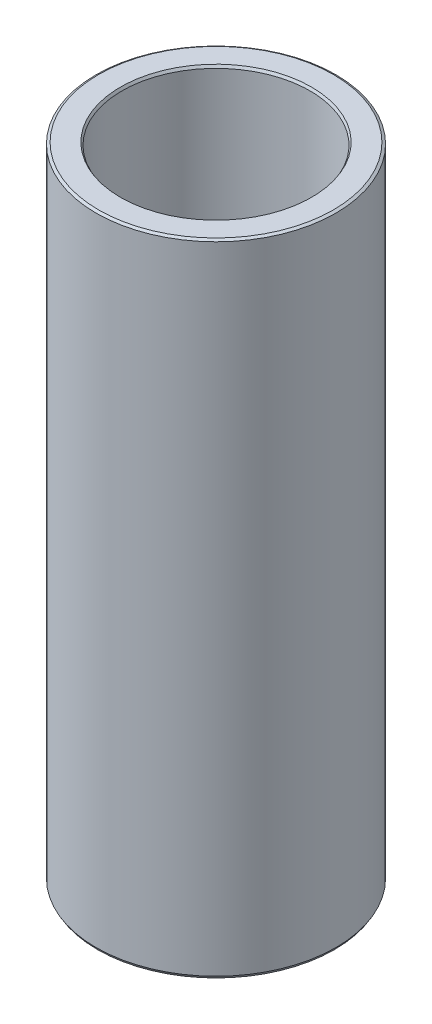
ISO-10303-21;
HEADER;
FILE_DESCRIPTION(('STEP AP214'),'2;1');
FILE_NAME('part.step','',(''),(''),'','','');
FILE_SCHEMA(('AUTOMOTIVE_DESIGN { 1 0 10303 214 1 1 1 1 }'));
ENDSEC;
DATA;
#1=APPLICATION_CONTEXT('core data for automotive mechanical design processes');
#2=APPLICATION_PROTOCOL_DEFINITION('international standard','automotive_design',2000,#1);
#3=PRODUCT_CONTEXT('',#1,'mechanical');
#4=PRODUCT('Part','Part','',(#3));
#5=PRODUCT_RELATED_PRODUCT_CATEGORY('part','',(#4));
#6=PRODUCT_DEFINITION_FORMATION('','',#4);
#7=PRODUCT_DEFINITION_CONTEXT('part definition',#1,'design');
#8=PRODUCT_DEFINITION('design','',#6,#7);
#9=PRODUCT_DEFINITION_SHAPE('','',#8);
#10=(LENGTH_UNIT() NAMED_UNIT(*) SI_UNIT(.MILLI.,.METRE.));
#11=(NAMED_UNIT(*) PLANE_ANGLE_UNIT() SI_UNIT($,.RADIAN.));
#12=(NAMED_UNIT(*) SI_UNIT($,.STERADIAN.) SOLID_ANGLE_UNIT());
#13=UNCERTAINTY_MEASURE_WITH_UNIT(LENGTH_MEASURE(1.E-05),#10,'distance_accuracy_value','');
#14=(GEOMETRIC_REPRESENTATION_CONTEXT(3) GLOBAL_UNCERTAINTY_ASSIGNED_CONTEXT((#13)) GLOBAL_UNIT_ASSIGNED_CONTEXT((#10,
#11,#12)) REPRESENTATION_CONTEXT('',''));
#15=CARTESIAN_POINT('',(0.,0.,0.));
#16=DIRECTION('',(0.,0.,1.));
#17=DIRECTION('',(1.,0.,0.));
#18=AXIS2_PLACEMENT_3D('',#15,#16,#17);
#19=CARTESIAN_POINT('',(0.,320.300888699564,0.));
#20=DIRECTION('',(0.,-1.,0.));
#21=DIRECTION('',(0.,0.,-1.));
#22=AXIS2_PLACEMENT_3D('',#19,#20,#21);
#23=CYLINDRICAL_SURFACE('',#22,60.);
#24=CARTESIAN_POINT('',(0.,1.28127196468975,0.));
#25=DIRECTION('',(0.,1.,0.));
#26=DIRECTION('',(0.,0.,1.));
#27=AXIS2_PLACEMENT_3D('',#24,#25,#26);
#28=CIRCLE('',#27,60.);
#29=CARTESIAN_POINT('',(0.,1.28127196468975,60.));
#30=VERTEX_POINT('',#29);
#31=EDGE_CURVE('E10',#30,#30,#28,.T.);
#32=ORIENTED_EDGE('',*,*,#31,.T.);
#33=EDGE_LOOP('',(#32));
#34=FACE_BOUND('',#33,.T.);
#35=CARTESIAN_POINT('',(0.,319.561145985845,0.));
#36=DIRECTION('',(0.,1.,0.));
#37=DIRECTION('',(0.,0.,1.));
#38=AXIS2_PLACEMENT_3D('',#35,#36,#37);
#39=CIRCLE('',#38,60.);
#40=CARTESIAN_POINT('',(0.,319.561145985845,60.));
#41=VERTEX_POINT('',#40);
#42=EDGE_CURVE('E50',#41,#41,#39,.F.);
#43=ORIENTED_EDGE('',*,*,#42,.T.);
#44=EDGE_LOOP('',(#43));
#45=FACE_BOUND('',#44,.T.);
#46=ADVANCED_FACE('F39',(#34,#45),#23,.T.);
#47=CARTESIAN_POINT('',(0.,320.300888699564,0.));
#48=DIRECTION('',(0.,1.,0.));
#49=DIRECTION('',(0.,0.,1.));
#50=AXIS2_PLACEMENT_3D('',#47,#48,#49);
#51=PLANE('',#50);
#52=CARTESIAN_POINT('',(0.,320.300888699564,0.));
#53=DIRECTION('',(0.,1.,0.));
#54=DIRECTION('',(0.,0.,1.));
#55=AXIS2_PLACEMENT_3D('',#52,#53,#54);
#56=CIRCLE('',#55,47.8190559067818);
#57=CARTESIAN_POINT('',(0.,320.300888699564,47.8190559067818));
#58=VERTEX_POINT('',#57);
#59=EDGE_CURVE('E58',#58,#58,#56,.F.);
#60=ORIENTED_EDGE('',*,*,#59,.T.);
#61=EDGE_LOOP('',(#60));
#62=FACE_BOUND('',#61,.T.);
#63=CARTESIAN_POINT('',(0.,320.300888699564,0.));
#64=DIRECTION('',(0.,1.,0.));
#65=DIRECTION('',(0.,0.,1.));
#66=AXIS2_PLACEMENT_3D('',#63,#64,#65);
#67=CIRCLE('',#66,58.7187280353102);
#68=CARTESIAN_POINT('',(0.,320.300888699564,58.7187280353102));
#69=VERTEX_POINT('',#68);
#70=EDGE_CURVE('E61',#69,#69,#67,.T.);
#71=ORIENTED_EDGE('',*,*,#70,.T.);
#72=EDGE_LOOP('',(#71));
#73=FACE_BOUND('',#72,.T.);
#74=ADVANCED_FACE('F88',(#62,#73),#51,.T.);
#75=CARTESIAN_POINT('',(0.,0.,0.));
#76=DIRECTION('',(0.,1.,0.));
#77=DIRECTION('',(0.,0.,1.));
#78=AXIS2_PLACEMENT_3D('',#75,#76,#77);
#79=PLANE('',#78);
#80=CARTESIAN_POINT('',(0.,0.,0.));
#81=DIRECTION('',(0.,1.,0.));
#82=DIRECTION('',(0.,0.,1.));
#83=AXIS2_PLACEMENT_3D('',#80,#81,#82);
#84=CIRCLE('',#83,48.3605851577527);
#85=CARTESIAN_POINT('',(0.,0.,48.3605851577527));
#86=VERTEX_POINT('',#85);
#87=EDGE_CURVE('E51',#86,#86,#84,.T.);
#88=ORIENTED_EDGE('',*,*,#87,.T.);
#89=EDGE_LOOP('',(#88));
#90=FACE_BOUND('',#89,.T.);
#91=CARTESIAN_POINT('',(0.,0.,0.));
#92=DIRECTION('',(0.,1.,0.));
#93=DIRECTION('',(0.,0.,1.));
#94=AXIS2_PLACEMENT_3D('',#91,#92,#93);
#95=CIRCLE('',#94,59.2602572862813);
#96=CARTESIAN_POINT('',(0.,0.,59.2602572862813));
#97=VERTEX_POINT('',#96);
#98=EDGE_CURVE('E54',#97,#97,#95,.F.);
#99=ORIENTED_EDGE('',*,*,#98,.T.);
#100=EDGE_LOOP('',(#99));
#101=FACE_BOUND('',#100,.T.);
#102=ADVANCED_FACE('F83',(#90,#101),#79,.F.);
#103=CARTESIAN_POINT('',(0.,320.300888699564,0.));
#104=DIRECTION('',(0.,-1.,0.));
#105=DIRECTION('',(0.,0.,-1.));
#106=AXIS2_PLACEMENT_3D('',#103,#104,#105);
#107=CYLINDRICAL_SURFACE('',#106,47.079313193063);
#108=CARTESIAN_POINT('',(0.,319.019616734874,0.));
#109=DIRECTION('',(0.,1.,0.));
#110=DIRECTION('',(0.,0.,1.));
#111=AXIS2_PLACEMENT_3D('',#108,#109,#110);
#112=CIRCLE('',#111,47.079313193063);
#113=CARTESIAN_POINT('',(0.,319.019616734874,47.079313193063));
#114=VERTEX_POINT('',#113);
#115=EDGE_CURVE('E67',#114,#114,#112,.T.);
#116=ORIENTED_EDGE('',*,*,#115,.T.);
#117=EDGE_LOOP('',(#116));
#118=FACE_BOUND('',#117,.T.);
#119=CARTESIAN_POINT('',(0.,0.739742713718738,0.));
#120=DIRECTION('',(0.,1.,0.));
#121=DIRECTION('',(0.,0.,1.));
#122=AXIS2_PLACEMENT_3D('',#119,#120,#121);
#123=CIRCLE('',#122,47.079313193063);
#124=CARTESIAN_POINT('',(0.,0.739742713718738,47.079313193063));
#125=VERTEX_POINT('',#124);
#126=EDGE_CURVE('E69',#125,#125,#123,.F.);
#127=ORIENTED_EDGE('',*,*,#126,.T.);
#128=EDGE_LOOP('',(#127));
#129=FACE_BOUND('',#128,.T.);
#130=ADVANCED_FACE('F71',(#118,#129),#107,.F.);
#131=CARTESIAN_POINT('',(0.,319.019616734874,0.));
#132=DIRECTION('',(0.,1.,0.));
#133=DIRECTION('',(0.,0.,1.));
#134=AXIS2_PLACEMENT_3D('',#131,#132,#133);
#135=CONICAL_SURFACE('',#134,47.079313193063,0.523598775598313);
#136=ORIENTED_EDGE('',*,*,#59,.F.);
#137=EDGE_LOOP('',(#136));
#138=FACE_BOUND('',#137,.T.);
#139=ORIENTED_EDGE('',*,*,#115,.F.);
#140=EDGE_LOOP('',(#139));
#141=FACE_BOUND('',#140,.T.);
#142=ADVANCED_FACE('F77',(#138,#141),#135,.F.);
#143=CARTESIAN_POINT('',(0.,0.,0.));
#144=DIRECTION('',(0.,-1.,0.));
#145=DIRECTION('',(0.,0.,-1.));
#146=AXIS2_PLACEMENT_3D('',#143,#144,#145);
#147=CONICAL_SURFACE('',#146,48.3605851577527,1.0471975511966);
#148=ORIENTED_EDGE('',*,*,#126,.F.);
#149=EDGE_LOOP('',(#148));
#150=FACE_BOUND('',#149,.T.);
#151=ORIENTED_EDGE('',*,*,#87,.F.);
#152=EDGE_LOOP('',(#151));
#153=FACE_BOUND('',#152,.T.);
#154=ADVANCED_FACE('F73',(#150,#153),#147,.F.);
#155=CARTESIAN_POINT('',(0.,1.28127196468975,0.));
#156=DIRECTION('',(0.,1.,0.));
#157=DIRECTION('',(0.,0.,1.));
#158=AXIS2_PLACEMENT_3D('',#155,#156,#157);
#159=CONICAL_SURFACE('',#158,60.,0.523598775598295);
#160=CARTESIAN_POINT('',(0.,0.,59.2602572862813));
#161=CARTESIAN_POINT('',(0.,0.0133465829655165,59.2679629395492));
#162=CARTESIAN_POINT('',(0.,0.0266931659310352,59.2756685928171));
#163=CARTESIAN_POINT('',(0.,0.0533863318620725,59.2910798993529));
#164=CARTESIAN_POINT('',(0.,0.0667329148275912,59.2987855526208));
#165=CARTESIAN_POINT('',(0.,0.0934260807586276,59.3141968591566));
#166=CARTESIAN_POINT('',(0.,0.106772663724145,59.3219025124245));
#167=CARTESIAN_POINT('',(0.,0.133465829655181,59.3373138189603));
#168=CARTESIAN_POINT('',(0.,0.1468124126207,59.3450194722282));
#169=CARTESIAN_POINT('',(0.,0.173505578551736,59.360430778764));
#170=CARTESIAN_POINT('',(0.,0.186852161517254,59.3681364320319));
#171=CARTESIAN_POINT('',(0.,0.21354532744829,59.3835477385677));
#172=CARTESIAN_POINT('',(0.,0.226891910413809,59.3912533918356));
#173=CARTESIAN_POINT('',(0.,0.253585076344846,59.4066646983714));
#174=CARTESIAN_POINT('',(0.,0.266931659310364,59.4143703516393));
#175=CARTESIAN_POINT('',(0.,0.2936248252414,59.4297816581751));
#176=CARTESIAN_POINT('',(0.,0.306971408206918,59.437487311443));
#177=CARTESIAN_POINT('',(0.,0.333664574137954,59.4528986179788));
#178=CARTESIAN_POINT('',(0.,0.347011157103472,59.4606042712468));
#179=CARTESIAN_POINT('',(0.,0.373704323034508,59.4760155777826));
#180=CARTESIAN_POINT('',(0.,0.387050906000027,59.4837212310505));
#181=CARTESIAN_POINT('',(0.,0.413744071931064,59.4991325375863));
#182=CARTESIAN_POINT('',(0.,0.427090654896582,59.5068381908542));
#183=CARTESIAN_POINT('',(0.,0.453783820827618,59.52224949739));
#184=CARTESIAN_POINT('',(0.,0.467130403793136,59.5299551506579));
#185=CARTESIAN_POINT('',(0.,0.493823569724172,59.5453664571937));
#186=CARTESIAN_POINT('',(0.,0.50717015268969,59.5530721104616));
#187=CARTESIAN_POINT('',(0.,0.533863318620727,59.5684834169974));
#188=CARTESIAN_POINT('',(0.,0.547209901586245,59.5761890702653));
#189=CARTESIAN_POINT('',(0.,0.573903067517282,59.5916003768011));
#190=CARTESIAN_POINT('',(0.,0.5872496504828,59.599306030069));
#191=CARTESIAN_POINT('',(0.,0.613942816413836,59.6147173366048));
#192=CARTESIAN_POINT('',(0.,0.627289399379354,59.6224229898727));
#193=CARTESIAN_POINT('',(0.,0.653982565310391,59.6378342964085));
#194=CARTESIAN_POINT('',(0.,0.667329148275908,59.6455399496764));
#195=CARTESIAN_POINT('',(0.,0.694022314206945,59.6609512562122));
#196=CARTESIAN_POINT('',(0.,0.707368897172464,59.6686569094801));
#197=CARTESIAN_POINT('',(0.,0.7340620631035,59.6840682160159));
#198=CARTESIAN_POINT('',(0.,0.747408646069018,59.6917738692839));
#199=CARTESIAN_POINT('',(0.,0.774101812000054,59.7071851758197));
#200=CARTESIAN_POINT('',(0.,0.787448394965573,59.7148908290876));
#201=CARTESIAN_POINT('',(0.,0.814141560896609,59.7303021356234));
#202=CARTESIAN_POINT('',(0.,0.827488143862126,59.7380077888913));
#203=CARTESIAN_POINT('',(0.,0.854181309793163,59.7534190954271));
#204=CARTESIAN_POINT('',(0.,0.867527892758682,59.761124748695));
#205=CARTESIAN_POINT('',(0.,0.894221058689718,59.7765360552308));
#206=CARTESIAN_POINT('',(0.,0.907567641655236,59.7842417084987));
#207=CARTESIAN_POINT('',(0.,0.934260807586272,59.7996530150345));
#208=CARTESIAN_POINT('',(0.,0.947607390551791,59.8073586683024));
#209=CARTESIAN_POINT('',(0.,0.974300556482827,59.8227699748382));
#210=CARTESIAN_POINT('',(0.,0.987647139448344,59.8304756281061));
#211=CARTESIAN_POINT('',(0.,1.01434030537938,59.8458869346419));
#212=CARTESIAN_POINT('',(0.,1.0276868883449,59.8535925879098));
#213=CARTESIAN_POINT('',(0.,1.05438005427594,59.8690038944456));
#214=CARTESIAN_POINT('',(0.,1.06772663724145,59.8767095477135));
#215=CARTESIAN_POINT('',(0.,1.09441980317249,59.8921208542493));
#216=CARTESIAN_POINT('',(0.,1.10776638613801,59.8998265075173));
#217=CARTESIAN_POINT('',(0.,1.13445955206905,59.9152378140531));
#218=CARTESIAN_POINT('',(0.,1.14780613503456,59.922943467321));
#219=CARTESIAN_POINT('',(0.,1.1744993009656,59.9383547738568));
#220=CARTESIAN_POINT('',(0.,1.18784588393112,59.9460604271247));
#221=CARTESIAN_POINT('',(0.,1.21453904986215,59.9614717336605));
#222=CARTESIAN_POINT('',(0.,1.22788563282767,59.9691773869284));
#223=CARTESIAN_POINT('',(0.,1.25457879875871,59.9845886934642));
#224=CARTESIAN_POINT('',(0.,1.26792538172423,59.9922943467321));
#225=CARTESIAN_POINT('',(0.,1.28127196468975,60.));
#226=B_SPLINE_CURVE_WITH_KNOTS('',3,(#160,#161,#162,#163,#164,#165,#166,#167,#168,#169,#170,
#171,#172,#173,#174,#175,#176,#177,#178,#179,#180,#181,#182,#183,#184,#185,#186,#187,#188,#189,
#190,#191,#192,#193,#194,#195,#196,#197,#198,#199,#200,#201,#202,#203,#204,#205,#206,#207,#208,
#209,#210,#211,#212,#213,#214,#215,#216,#217,#218,#219,#220,#221,#222,#223,#224,#225),
.UNSPECIFIED.,.F.,.F.,(4,2,2,2,2,2,2,2,2,2,2,2,2,2,2,2,2,2,2,2,2,2,2,2,2,2,2,2,2,2,2,2,4),(0.,
0.0462339196074223,0.0924678392148412,0.138701758822264,0.184935678429686,0.231169598037108,
0.277403517644527,0.323637437251949,0.369871356859372,0.416105276466794,0.462339196074213,
0.508573115681635,0.554807035289058,0.60104095489648,0.647274874503899,0.693508794111321,
0.739742713718744,0.785976633326166,0.832210552933585,0.878444472541007,0.92467839214843,
0.970912311755852,1.01714623136327,1.06338015097069,1.10961407057812,1.15584799018554,
1.20208190979296,1.24831582940038,1.2945497490078,1.34078366861522,1.38701758822264,
1.43325150783006,1.47948542743749),.UNSPECIFIED.);
#227=EDGE_CURVE('BSEAM76',#97,#30,#226,.T.);
#228=ORIENTED_EDGE('',*,*,#98,.F.);
#229=ORIENTED_EDGE('',*,*,#31,.F.);
#230=ORIENTED_EDGE('',*,*,#227,.T.);
#231=ORIENTED_EDGE('',*,*,#227,.F.);
#232=EDGE_LOOP('',(#228,#230,#229,#231));
#233=FACE_BOUND('',#232,.T.);
#234=ADVANCED_FACE('F76',(#233),#159,.T.);
#235=CARTESIAN_POINT('',(0.,320.300888699564,0.));
#236=DIRECTION('',(0.,-1.,0.));
#237=DIRECTION('',(0.,0.,-1.));
#238=AXIS2_PLACEMENT_3D('',#235,#236,#237);
#239=CONICAL_SURFACE('',#238,58.7187280353102,1.0471975511966);
#240=ORIENTED_EDGE('',*,*,#42,.F.);
#241=EDGE_LOOP('',(#240));
#242=FACE_BOUND('',#241,.T.);
#243=ORIENTED_EDGE('',*,*,#70,.F.);
#244=EDGE_LOOP('',(#243));
#245=FACE_BOUND('',#244,.T.);
#246=ADVANCED_FACE('F45',(#242,#245),#239,.T.);
#247=CLOSED_SHELL('',(#46,#74,#102,#130,#142,#154,#234,#246));
#248=MANIFOLD_SOLID_BREP('B2',#247);
#249=ADVANCED_BREP_SHAPE_REPRESENTATION('',(#18,#248),#14);
#250=SHAPE_DEFINITION_REPRESENTATION(#9,#249);
ENDSEC;
END-ISO-10303-21;
